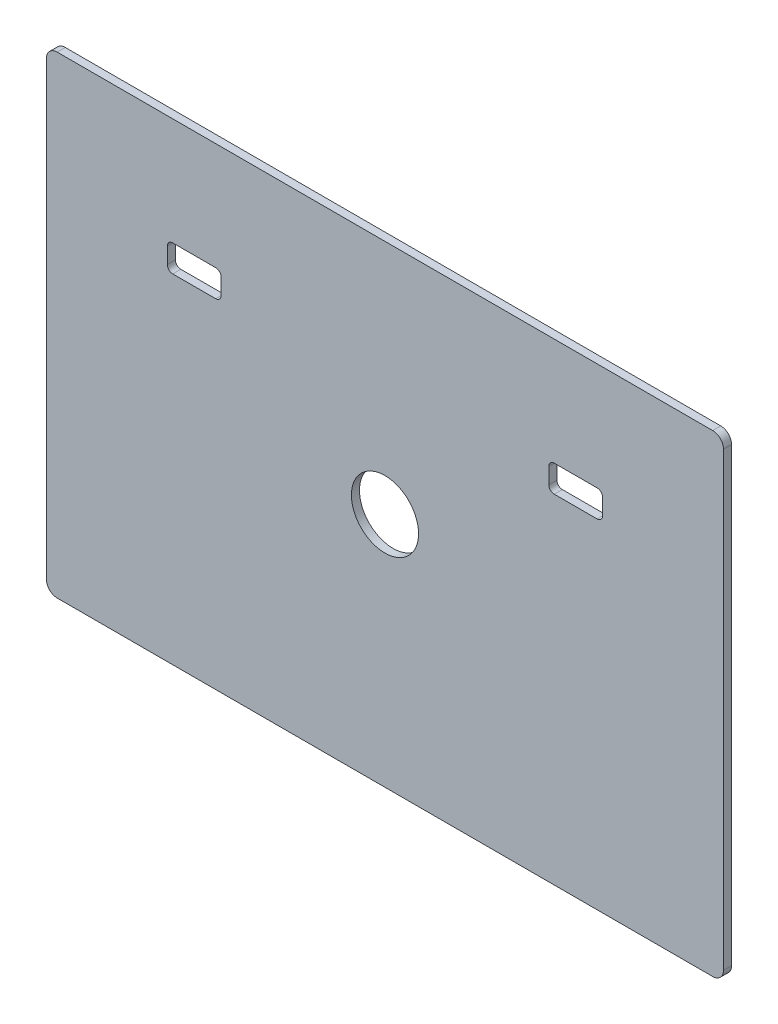
ISO-10303-21;
HEADER;
FILE_DESCRIPTION(('STEP AP214'),'2;1');
FILE_NAME('part.step','',(''),(''),'','','');
FILE_SCHEMA(('AUTOMOTIVE_DESIGN { 1 0 10303 214 1 1 1 1 }'));
ENDSEC;
DATA;
#1=APPLICATION_CONTEXT('core data for automotive mechanical design processes');
#2=APPLICATION_PROTOCOL_DEFINITION('international standard','automotive_design',2000,#1);
#3=PRODUCT_CONTEXT('',#1,'mechanical');
#4=PRODUCT('Part','Part','',(#3));
#5=PRODUCT_RELATED_PRODUCT_CATEGORY('part','',(#4));
#6=PRODUCT_DEFINITION_FORMATION('','',#4);
#7=PRODUCT_DEFINITION_CONTEXT('part definition',#1,'design');
#8=PRODUCT_DEFINITION('design','',#6,#7);
#9=PRODUCT_DEFINITION_SHAPE('','',#8);
#10=(LENGTH_UNIT() NAMED_UNIT(*) SI_UNIT(.MILLI.,.METRE.));
#11=(NAMED_UNIT(*) PLANE_ANGLE_UNIT() SI_UNIT($,.RADIAN.));
#12=(NAMED_UNIT(*) SI_UNIT($,.STERADIAN.) SOLID_ANGLE_UNIT());
#13=UNCERTAINTY_MEASURE_WITH_UNIT(LENGTH_MEASURE(1.E-05),#10,'distance_accuracy_value','');
#14=(GEOMETRIC_REPRESENTATION_CONTEXT(3) GLOBAL_UNCERTAINTY_ASSIGNED_CONTEXT((#13)) GLOBAL_UNIT_ASSIGNED_CONTEXT((#10,
#11,#12)) REPRESENTATION_CONTEXT('',''));
#15=CARTESIAN_POINT('',(0.,0.,0.));
#16=DIRECTION('',(0.,0.,1.));
#17=DIRECTION('',(1.,0.,0.));
#18=AXIS2_PLACEMENT_3D('',#15,#16,#17);
#19=CARTESIAN_POINT('',(126.,88.,3.));
#20=DIRECTION('',(-1.,0.,0.));
#21=DIRECTION('',(0.,-1.,0.));
#22=AXIS2_PLACEMENT_3D('',#19,#20,#21);
#23=PLANE('',#22);
#24=DIRECTION('',(0.,1.,0.));
#25=VECTOR('',#24,1.);
#26=CARTESIAN_POINT('',(126.,88.,3.));
#27=LINE('',#26,#25);
#28=CARTESIAN_POINT('',(126.,-84.,3.));
#29=VERTEX_POINT('',#28);
#30=CARTESIAN_POINT('',(126.,84.,3.));
#31=VERTEX_POINT('',#30);
#32=EDGE_CURVE('E245',#29,#31,#27,.T.);
#33=ORIENTED_EDGE('',*,*,#32,.F.);
#34=DIRECTION('',(0.,0.,-1.));
#35=VECTOR('',#34,1.);
#36=CARTESIAN_POINT('',(126.,-84.,3.));
#37=LINE('',#36,#35);
#38=CARTESIAN_POINT('',(126.,-84.,0.));
#39=VERTEX_POINT('',#38);
#40=EDGE_CURVE('E406',#29,#39,#37,.T.);
#41=ORIENTED_EDGE('',*,*,#40,.T.);
#42=DIRECTION('',(0.,1.,0.));
#43=VECTOR('',#42,1.);
#44=CARTESIAN_POINT('',(126.,88.,0.));
#45=LINE('',#44,#43);
#46=CARTESIAN_POINT('',(126.,84.,0.));
#47=VERTEX_POINT('',#46);
#48=EDGE_CURVE('E260',#39,#47,#45,.T.);
#49=ORIENTED_EDGE('',*,*,#48,.T.);
#50=DIRECTION('',(0.,0.,-1.));
#51=VECTOR('',#50,1.);
#52=CARTESIAN_POINT('',(126.,84.,3.));
#53=LINE('',#52,#51);
#54=EDGE_CURVE('E403',#47,#31,#53,.F.);
#55=ORIENTED_EDGE('',*,*,#54,.T.);
#56=EDGE_LOOP('',(#33,#41,#49,#55));
#57=FACE_BOUND('',#56,.T.);
#58=ADVANCED_FACE('F39',(#57),#23,.F.);
#59=CARTESIAN_POINT('',(-126.,88.,3.));
#60=DIRECTION('',(0.,-1.,0.));
#61=DIRECTION('',(0.,0.,-1.));
#62=AXIS2_PLACEMENT_3D('',#59,#60,#61);
#63=PLANE('',#62);
#64=DIRECTION('',(-1.,0.,0.));
#65=VECTOR('',#64,1.);
#66=CARTESIAN_POINT('',(-126.,88.,3.));
#67=LINE('',#66,#65);
#68=CARTESIAN_POINT('',(122.,88.,3.));
#69=VERTEX_POINT('',#68);
#70=CARTESIAN_POINT('',(-122.,88.,3.));
#71=VERTEX_POINT('',#70);
#72=EDGE_CURVE('E248',#69,#71,#67,.T.);
#73=ORIENTED_EDGE('',*,*,#72,.F.);
#74=DIRECTION('',(0.,0.,-1.));
#75=VECTOR('',#74,1.);
#76=CARTESIAN_POINT('',(122.,88.,3.));
#77=LINE('',#76,#75);
#78=CARTESIAN_POINT('',(122.,88.,0.));
#79=VERTEX_POINT('',#78);
#80=EDGE_CURVE('E11',#69,#79,#77,.T.);
#81=ORIENTED_EDGE('',*,*,#80,.T.);
#82=DIRECTION('',(-1.,0.,0.));
#83=VECTOR('',#82,1.);
#84=CARTESIAN_POINT('',(-126.,88.,0.));
#85=LINE('',#84,#83);
#86=CARTESIAN_POINT('',(-122.,88.,0.));
#87=VERTEX_POINT('',#86);
#88=EDGE_CURVE('E264',#79,#87,#85,.T.);
#89=ORIENTED_EDGE('',*,*,#88,.T.);
#90=DIRECTION('',(0.,0.,-1.));
#91=VECTOR('',#90,1.);
#92=CARTESIAN_POINT('',(-122.,88.,3.));
#93=LINE('',#92,#91);
#94=EDGE_CURVE('E48',#87,#71,#93,.F.);
#95=ORIENTED_EDGE('',*,*,#94,.T.);
#96=EDGE_LOOP('',(#73,#81,#89,#95));
#97=FACE_BOUND('',#96,.T.);
#98=ADVANCED_FACE('F493',(#97),#63,.F.);
#99=CARTESIAN_POINT('',(-126.,88.,3.));
#100=DIRECTION('',(1.,0.,0.));
#101=DIRECTION('',(0.,0.,-1.));
#102=AXIS2_PLACEMENT_3D('',#99,#100,#101);
#103=PLANE('',#102);
#104=DIRECTION('',(0.,-1.,0.));
#105=VECTOR('',#104,1.);
#106=CARTESIAN_POINT('',(-126.,88.,0.));
#107=LINE('',#106,#105);
#108=CARTESIAN_POINT('',(-126.,84.,0.));
#109=VERTEX_POINT('',#108);
#110=CARTESIAN_POINT('',(-126.,-84.,0.));
#111=VERTEX_POINT('',#110);
#112=EDGE_CURVE('E268',#109,#111,#107,.T.);
#113=ORIENTED_EDGE('',*,*,#112,.T.);
#114=DIRECTION('',(0.,0.,-1.));
#115=VECTOR('',#114,1.);
#116=CARTESIAN_POINT('',(-126.,-84.,3.));
#117=LINE('',#116,#115);
#118=CARTESIAN_POINT('',(-126.,-84.,3.));
#119=VERTEX_POINT('',#118);
#120=EDGE_CURVE('E389',#111,#119,#117,.F.);
#121=ORIENTED_EDGE('',*,*,#120,.T.);
#122=DIRECTION('',(0.,-1.,0.));
#123=VECTOR('',#122,1.);
#124=CARTESIAN_POINT('',(-126.,88.,3.));
#125=LINE('',#124,#123);
#126=CARTESIAN_POINT('',(-126.,84.,3.));
#127=VERTEX_POINT('',#126);
#128=EDGE_CURVE('E252',#127,#119,#125,.T.);
#129=ORIENTED_EDGE('',*,*,#128,.F.);
#130=DIRECTION('',(0.,0.,-1.));
#131=VECTOR('',#130,1.);
#132=CARTESIAN_POINT('',(-126.,84.,3.));
#133=LINE('',#132,#131);
#134=EDGE_CURVE('E385',#127,#109,#133,.T.);
#135=ORIENTED_EDGE('',*,*,#134,.T.);
#136=EDGE_LOOP('',(#113,#121,#129,#135));
#137=FACE_BOUND('',#136,.T.);
#138=ADVANCED_FACE('F499',(#137),#103,.F.);
#139=CARTESIAN_POINT('',(-126.,-88.,3.));
#140=DIRECTION('',(0.,1.,0.));
#141=DIRECTION('',(0.,0.,1.));
#142=AXIS2_PLACEMENT_3D('',#139,#140,#141);
#143=PLANE('',#142);
#144=DIRECTION('',(1.,0.,0.));
#145=VECTOR('',#144,1.);
#146=CARTESIAN_POINT('',(-126.,-88.,3.));
#147=LINE('',#146,#145);
#148=CARTESIAN_POINT('',(-122.,-88.,3.));
#149=VERTEX_POINT('',#148);
#150=CARTESIAN_POINT('',(122.,-88.,3.));
#151=VERTEX_POINT('',#150);
#152=EDGE_CURVE('E256',#149,#151,#147,.T.);
#153=ORIENTED_EDGE('',*,*,#152,.F.);
#154=DIRECTION('',(0.,0.,-1.));
#155=VECTOR('',#154,1.);
#156=CARTESIAN_POINT('',(-122.,-88.,3.));
#157=LINE('',#156,#155);
#158=CARTESIAN_POINT('',(-122.,-88.,0.));
#159=VERTEX_POINT('',#158);
#160=EDGE_CURVE('E369',#149,#159,#157,.T.);
#161=ORIENTED_EDGE('',*,*,#160,.T.);
#162=DIRECTION('',(1.,0.,0.));
#163=VECTOR('',#162,1.);
#164=CARTESIAN_POINT('',(-126.,-88.,0.));
#165=LINE('',#164,#163);
#166=CARTESIAN_POINT('',(122.,-88.,0.));
#167=VERTEX_POINT('',#166);
#168=EDGE_CURVE('E249',#159,#167,#165,.T.);
#169=ORIENTED_EDGE('',*,*,#168,.T.);
#170=DIRECTION('',(0.,0.,-1.));
#171=VECTOR('',#170,1.);
#172=CARTESIAN_POINT('',(122.,-88.,3.));
#173=LINE('',#172,#171);
#174=EDGE_CURVE('E366',#167,#151,#173,.F.);
#175=ORIENTED_EDGE('',*,*,#174,.T.);
#176=EDGE_LOOP('',(#153,#161,#169,#175));
#177=FACE_BOUND('',#176,.T.);
#178=ADVANCED_FACE('F562',(#177),#143,.F.);
#179=CARTESIAN_POINT('',(0.,0.,3.));
#180=DIRECTION('',(0.,0.,1.));
#181=DIRECTION('',(1.,0.,0.));
#182=AXIS2_PLACEMENT_3D('',#179,#180,#181);
#183=PLANE('',#182);
#184=CARTESIAN_POINT('',(0.,0.,3.));
#185=DIRECTION('',(0.,0.,1.));
#186=DIRECTION('',(1.,0.,0.));
#187=AXIS2_PLACEMENT_3D('',#184,#185,#186);
#188=CIRCLE('',#187,12.5);
#189=CARTESIAN_POINT('',(12.5,0.,3.));
#190=VERTEX_POINT('',#189);
#191=EDGE_CURVE('E413',#190,#190,#188,.T.);
#192=ORIENTED_EDGE('',*,*,#191,.F.);
#193=EDGE_LOOP('',(#192));
#194=FACE_BOUND('',#193,.T.);
#195=DIRECTION('',(0.,-1.,0.));
#196=VECTOR('',#195,1.);
#197=CARTESIAN_POINT('',(-81.,48.,3.));
#198=LINE('',#197,#196);
#199=CARTESIAN_POINT('',(-81.,46.,3.));
#200=VERTEX_POINT('',#199);
#201=CARTESIAN_POINT('',(-81.,40.,3.));
#202=VERTEX_POINT('',#201);
#203=EDGE_CURVE('E445',#200,#202,#198,.T.);
#204=ORIENTED_EDGE('',*,*,#203,.F.);
#205=CARTESIAN_POINT('',(-79.,46.,3.));
#206=DIRECTION('',(0.,0.,1.));
#207=DIRECTION('',(1.,0.,0.));
#208=AXIS2_PLACEMENT_3D('',#205,#206,#207);
#209=CIRCLE('',#208,2.);
#210=CARTESIAN_POINT('',(-79.,48.,3.));
#211=VERTEX_POINT('',#210);
#212=EDGE_CURVE('E354',#200,#211,#209,.F.);
#213=ORIENTED_EDGE('',*,*,#212,.T.);
#214=DIRECTION('',(-1.,0.,0.));
#215=VECTOR('',#214,1.);
#216=CARTESIAN_POINT('',(-81.,48.,3.));
#217=LINE('',#216,#215);
#218=CARTESIAN_POINT('',(-63.,48.,3.));
#219=VERTEX_POINT('',#218);
#220=EDGE_CURVE('E433',#219,#211,#217,.T.);
#221=ORIENTED_EDGE('',*,*,#220,.F.);
#222=CARTESIAN_POINT('',(-63.,46.,3.));
#223=DIRECTION('',(0.,0.,1.));
#224=DIRECTION('',(1.,0.,0.));
#225=AXIS2_PLACEMENT_3D('',#222,#223,#224);
#226=CIRCLE('',#225,2.);
#227=CARTESIAN_POINT('',(-61.,46.,3.));
#228=VERTEX_POINT('',#227);
#229=EDGE_CURVE('E360',#219,#228,#226,.F.);
#230=ORIENTED_EDGE('',*,*,#229,.T.);
#231=DIRECTION('',(0.,1.,0.));
#232=VECTOR('',#231,1.);
#233=CARTESIAN_POINT('',(-61.,48.,3.));
#234=LINE('',#233,#232);
#235=CARTESIAN_POINT('',(-61.,40.,3.));
#236=VERTEX_POINT('',#235);
#237=EDGE_CURVE('E437',#236,#228,#234,.T.);
#238=ORIENTED_EDGE('',*,*,#237,.F.);
#239=CARTESIAN_POINT('',(-63.,40.,3.));
#240=DIRECTION('',(0.,0.,1.));
#241=DIRECTION('',(1.,0.,0.));
#242=AXIS2_PLACEMENT_3D('',#239,#240,#241);
#243=CIRCLE('',#242,2.);
#244=CARTESIAN_POINT('',(-63.,38.,3.));
#245=VERTEX_POINT('',#244);
#246=EDGE_CURVE('E342',#236,#245,#243,.F.);
#247=ORIENTED_EDGE('',*,*,#246,.T.);
#248=DIRECTION('',(1.,0.,0.));
#249=VECTOR('',#248,1.);
#250=CARTESIAN_POINT('',(-81.,38.,3.));
#251=LINE('',#250,#249);
#252=CARTESIAN_POINT('',(-79.,38.,3.));
#253=VERTEX_POINT('',#252);
#254=EDGE_CURVE('E441',#253,#245,#251,.T.);
#255=ORIENTED_EDGE('',*,*,#254,.F.);
#256=CARTESIAN_POINT('',(-79.,40.,3.));
#257=DIRECTION('',(0.,0.,1.));
#258=DIRECTION('',(1.,0.,0.));
#259=AXIS2_PLACEMENT_3D('',#256,#257,#258);
#260=CIRCLE('',#259,2.);
#261=EDGE_CURVE('E348',#253,#202,#260,.F.);
#262=ORIENTED_EDGE('',*,*,#261,.T.);
#263=EDGE_LOOP('',(#204,#213,#221,#230,#238,#247,#255,#262));
#264=FACE_BOUND('',#263,.T.);
#265=DIRECTION('',(0.,1.,0.));
#266=VECTOR('',#265,1.);
#267=CARTESIAN_POINT('',(81.,38.,3.));
#268=LINE('',#267,#266);
#269=CARTESIAN_POINT('',(81.,40.,3.));
#270=VERTEX_POINT('',#269);
#271=CARTESIAN_POINT('',(81.,46.,3.));
#272=VERTEX_POINT('',#271);
#273=EDGE_CURVE('E241',#270,#272,#268,.T.);
#274=ORIENTED_EDGE('',*,*,#273,.F.);
#275=CARTESIAN_POINT('',(79.,40.,3.));
#276=DIRECTION('',(0.,0.,1.));
#277=DIRECTION('',(1.,0.,0.));
#278=AXIS2_PLACEMENT_3D('',#275,#276,#277);
#279=CIRCLE('',#278,2.);
#280=CARTESIAN_POINT('',(79.,38.,3.));
#281=VERTEX_POINT('',#280);
#282=EDGE_CURVE('E331',#270,#281,#279,.F.);
#283=ORIENTED_EDGE('',*,*,#282,.T.);
#284=DIRECTION('',(1.,0.,0.));
#285=VECTOR('',#284,1.);
#286=CARTESIAN_POINT('',(81.,38.,3.));
#287=LINE('',#286,#285);
#288=CARTESIAN_POINT('',(63.,38.,3.));
#289=VERTEX_POINT('',#288);
#290=EDGE_CURVE('E233',#289,#281,#287,.T.);
#291=ORIENTED_EDGE('',*,*,#290,.F.);
#292=CARTESIAN_POINT('',(63.,40.,3.));
#293=DIRECTION('',(0.,0.,1.));
#294=DIRECTION('',(1.,0.,0.));
#295=AXIS2_PLACEMENT_3D('',#292,#293,#294);
#296=CIRCLE('',#295,2.);
#297=CARTESIAN_POINT('',(61.,40.,3.));
#298=VERTEX_POINT('',#297);
#299=EDGE_CURVE('E231',#289,#298,#296,.F.);
#300=ORIENTED_EDGE('',*,*,#299,.T.);
#301=DIRECTION('',(0.,-1.,0.));
#302=VECTOR('',#301,1.);
#303=CARTESIAN_POINT('',(61.,38.,3.));
#304=LINE('',#303,#302);
#305=CARTESIAN_POINT('',(61.,46.,3.));
#306=VERTEX_POINT('',#305);
#307=EDGE_CURVE('E220',#306,#298,#304,.T.);
#308=ORIENTED_EDGE('',*,*,#307,.F.);
#309=CARTESIAN_POINT('',(63.,46.,3.));
#310=DIRECTION('',(0.,0.,1.));
#311=DIRECTION('',(1.,0.,0.));
#312=AXIS2_PLACEMENT_3D('',#309,#310,#311);
#313=CIRCLE('',#312,2.);
#314=CARTESIAN_POINT('',(63.,48.,3.));
#315=VERTEX_POINT('',#314);
#316=EDGE_CURVE('E202',#306,#315,#313,.F.);
#317=ORIENTED_EDGE('',*,*,#316,.T.);
#318=DIRECTION('',(-1.,0.,0.));
#319=VECTOR('',#318,1.);
#320=CARTESIAN_POINT('',(81.,48.,3.));
#321=LINE('',#320,#319);
#322=CARTESIAN_POINT('',(79.,48.,3.));
#323=VERTEX_POINT('',#322);
#324=EDGE_CURVE('E234',#323,#315,#321,.T.);
#325=ORIENTED_EDGE('',*,*,#324,.F.);
#326=CARTESIAN_POINT('',(79.,46.,3.));
#327=DIRECTION('',(0.,0.,1.));
#328=DIRECTION('',(1.,0.,0.));
#329=AXIS2_PLACEMENT_3D('',#326,#327,#328);
#330=CIRCLE('',#329,2.);
#331=EDGE_CURVE('E325',#323,#272,#330,.F.);
#332=ORIENTED_EDGE('',*,*,#331,.T.);
#333=EDGE_LOOP('',(#274,#283,#291,#300,#308,#317,#325,#332));
#334=FACE_BOUND('',#333,.T.);
#335=ORIENTED_EDGE('',*,*,#128,.T.);
#336=CARTESIAN_POINT('',(-122.,-84.,3.));
#337=DIRECTION('',(0.,0.,1.));
#338=DIRECTION('',(1.,0.,0.));
#339=AXIS2_PLACEMENT_3D('',#336,#337,#338);
#340=CIRCLE('',#339,4.);
#341=EDGE_CURVE('E400',#119,#149,#340,.T.);
#342=ORIENTED_EDGE('',*,*,#341,.T.);
#343=ORIENTED_EDGE('',*,*,#152,.T.);
#344=CARTESIAN_POINT('',(122.,-84.,3.));
#345=DIRECTION('',(0.,0.,1.));
#346=DIRECTION('',(1.,0.,0.));
#347=AXIS2_PLACEMENT_3D('',#344,#345,#346);
#348=CIRCLE('',#347,4.);
#349=EDGE_CURVE('E397',#151,#29,#348,.T.);
#350=ORIENTED_EDGE('',*,*,#349,.T.);
#351=ORIENTED_EDGE('',*,*,#32,.T.);
#352=CARTESIAN_POINT('',(122.,84.,3.));
#353=DIRECTION('',(0.,0.,1.));
#354=DIRECTION('',(1.,0.,0.));
#355=AXIS2_PLACEMENT_3D('',#352,#353,#354);
#356=CIRCLE('',#355,4.);
#357=EDGE_CURVE('E61',#31,#69,#356,.T.);
#358=ORIENTED_EDGE('',*,*,#357,.T.);
#359=ORIENTED_EDGE('',*,*,#72,.T.);
#360=CARTESIAN_POINT('',(-122.,84.,3.));
#361=DIRECTION('',(0.,0.,1.));
#362=DIRECTION('',(1.,0.,0.));
#363=AXIS2_PLACEMENT_3D('',#360,#361,#362);
#364=CIRCLE('',#363,4.);
#365=EDGE_CURVE('E392',#71,#127,#364,.T.);
#366=ORIENTED_EDGE('',*,*,#365,.T.);
#367=EDGE_LOOP('',(#335,#342,#343,#350,#351,#358,#359,#366));
#368=FACE_BOUND('',#367,.T.);
#369=ADVANCED_FACE('F229',(#194,#264,#334,#368),#183,.T.);
#370=CARTESIAN_POINT('',(0.,0.,0.));
#371=DIRECTION('',(0.,0.,1.));
#372=DIRECTION('',(1.,0.,0.));
#373=AXIS2_PLACEMENT_3D('',#370,#371,#372);
#374=PLANE('',#373);
#375=CARTESIAN_POINT('',(0.,0.,0.));
#376=DIRECTION('',(0.,0.,1.));
#377=DIRECTION('',(1.,0.,0.));
#378=AXIS2_PLACEMENT_3D('',#375,#376,#377);
#379=CIRCLE('',#378,12.5);
#380=CARTESIAN_POINT('',(12.5,0.,0.));
#381=VERTEX_POINT('',#380);
#382=EDGE_CURVE('E265',#381,#381,#379,.T.);
#383=ORIENTED_EDGE('',*,*,#382,.T.);
#384=EDGE_LOOP('',(#383));
#385=FACE_BOUND('',#384,.T.);
#386=DIRECTION('',(0.,1.,0.));
#387=VECTOR('',#386,1.);
#388=CARTESIAN_POINT('',(-61.,48.,0.));
#389=LINE('',#388,#387);
#390=CARTESIAN_POINT('',(-61.,40.,0.));
#391=VERTEX_POINT('',#390);
#392=CARTESIAN_POINT('',(-61.,46.,0.));
#393=VERTEX_POINT('',#392);
#394=EDGE_CURVE('E421',#391,#393,#389,.T.);
#395=ORIENTED_EDGE('',*,*,#394,.T.);
#396=CARTESIAN_POINT('',(-63.,46.,0.));
#397=DIRECTION('',(0.,0.,1.));
#398=DIRECTION('',(1.,0.,0.));
#399=AXIS2_PLACEMENT_3D('',#396,#397,#398);
#400=CIRCLE('',#399,2.);
#401=CARTESIAN_POINT('',(-63.,48.,0.));
#402=VERTEX_POINT('',#401);
#403=EDGE_CURVE('E363',#393,#402,#400,.T.);
#404=ORIENTED_EDGE('',*,*,#403,.T.);
#405=DIRECTION('',(-1.,0.,0.));
#406=VECTOR('',#405,1.);
#407=CARTESIAN_POINT('',(-81.,48.,0.));
#408=LINE('',#407,#406);
#409=CARTESIAN_POINT('',(-79.,48.,0.));
#410=VERTEX_POINT('',#409);
#411=EDGE_CURVE('E417',#402,#410,#408,.T.);
#412=ORIENTED_EDGE('',*,*,#411,.T.);
#413=CARTESIAN_POINT('',(-79.,46.,0.));
#414=DIRECTION('',(0.,0.,1.));
#415=DIRECTION('',(1.,0.,0.));
#416=AXIS2_PLACEMENT_3D('',#413,#414,#415);
#417=CIRCLE('',#416,2.);
#418=CARTESIAN_POINT('',(-81.,46.,0.));
#419=VERTEX_POINT('',#418);
#420=EDGE_CURVE('E357',#410,#419,#417,.T.);
#421=ORIENTED_EDGE('',*,*,#420,.T.);
#422=DIRECTION('',(0.,-1.,0.));
#423=VECTOR('',#422,1.);
#424=CARTESIAN_POINT('',(-81.,48.,0.));
#425=LINE('',#424,#423);
#426=CARTESIAN_POINT('',(-81.,40.,0.));
#427=VERTEX_POINT('',#426);
#428=EDGE_CURVE('E429',#419,#427,#425,.T.);
#429=ORIENTED_EDGE('',*,*,#428,.T.);
#430=CARTESIAN_POINT('',(-79.,40.,0.));
#431=DIRECTION('',(0.,0.,1.));
#432=DIRECTION('',(1.,0.,0.));
#433=AXIS2_PLACEMENT_3D('',#430,#431,#432);
#434=CIRCLE('',#433,2.);
#435=CARTESIAN_POINT('',(-79.,38.,0.));
#436=VERTEX_POINT('',#435);
#437=EDGE_CURVE('E351',#427,#436,#434,.T.);
#438=ORIENTED_EDGE('',*,*,#437,.T.);
#439=DIRECTION('',(1.,0.,0.));
#440=VECTOR('',#439,1.);
#441=CARTESIAN_POINT('',(-81.,38.,0.));
#442=LINE('',#441,#440);
#443=CARTESIAN_POINT('',(-63.,38.,0.));
#444=VERTEX_POINT('',#443);
#445=EDGE_CURVE('E425',#436,#444,#442,.T.);
#446=ORIENTED_EDGE('',*,*,#445,.T.);
#447=CARTESIAN_POINT('',(-63.,40.,0.));
#448=DIRECTION('',(0.,0.,1.));
#449=DIRECTION('',(1.,0.,0.));
#450=AXIS2_PLACEMENT_3D('',#447,#448,#449);
#451=CIRCLE('',#450,2.);
#452=EDGE_CURVE('E345',#444,#391,#451,.T.);
#453=ORIENTED_EDGE('',*,*,#452,.T.);
#454=EDGE_LOOP('',(#395,#404,#412,#421,#429,#438,#446,#453));
#455=FACE_BOUND('',#454,.T.);
#456=DIRECTION('',(0.,-1.,0.));
#457=VECTOR('',#456,1.);
#458=CARTESIAN_POINT('',(61.,38.,0.));
#459=LINE('',#458,#457);
#460=CARTESIAN_POINT('',(61.,46.,0.));
#461=VERTEX_POINT('',#460);
#462=CARTESIAN_POINT('',(61.,40.,0.));
#463=VERTEX_POINT('',#462);
#464=EDGE_CURVE('E223',#461,#463,#459,.T.);
#465=ORIENTED_EDGE('',*,*,#464,.T.);
#466=CARTESIAN_POINT('',(63.,40.,0.));
#467=DIRECTION('',(0.,0.,1.));
#468=DIRECTION('',(1.,0.,0.));
#469=AXIS2_PLACEMENT_3D('',#466,#467,#468);
#470=CIRCLE('',#469,2.);
#471=CARTESIAN_POINT('',(63.,38.,0.));
#472=VERTEX_POINT('',#471);
#473=EDGE_CURVE('E339',#463,#472,#470,.T.);
#474=ORIENTED_EDGE('',*,*,#473,.T.);
#475=DIRECTION('',(1.,0.,0.));
#476=VECTOR('',#475,1.);
#477=CARTESIAN_POINT('',(81.,38.,0.));
#478=LINE('',#477,#476);
#479=CARTESIAN_POINT('',(79.,38.,0.));
#480=VERTEX_POINT('',#479);
#481=EDGE_CURVE('E449',#472,#480,#478,.T.);
#482=ORIENTED_EDGE('',*,*,#481,.T.);
#483=CARTESIAN_POINT('',(79.,40.,0.));
#484=DIRECTION('',(0.,0.,1.));
#485=DIRECTION('',(1.,0.,0.));
#486=AXIS2_PLACEMENT_3D('',#483,#484,#485);
#487=CIRCLE('',#486,2.);
#488=CARTESIAN_POINT('',(81.,40.,0.));
#489=VERTEX_POINT('',#488);
#490=EDGE_CURVE('E334',#480,#489,#487,.T.);
#491=ORIENTED_EDGE('',*,*,#490,.T.);
#492=DIRECTION('',(0.,1.,0.));
#493=VECTOR('',#492,1.);
#494=CARTESIAN_POINT('',(81.,38.,0.));
#495=LINE('',#494,#493);
#496=CARTESIAN_POINT('',(81.,46.,0.));
#497=VERTEX_POINT('',#496);
#498=EDGE_CURVE('E239',#489,#497,#495,.T.);
#499=ORIENTED_EDGE('',*,*,#498,.T.);
#500=CARTESIAN_POINT('',(79.,46.,0.));
#501=DIRECTION('',(0.,0.,1.));
#502=DIRECTION('',(1.,0.,0.));
#503=AXIS2_PLACEMENT_3D('',#500,#501,#502);
#504=CIRCLE('',#503,2.);
#505=CARTESIAN_POINT('',(79.,48.,0.));
#506=VERTEX_POINT('',#505);
#507=EDGE_CURVE('E328',#497,#506,#504,.T.);
#508=ORIENTED_EDGE('',*,*,#507,.T.);
#509=DIRECTION('',(-1.,0.,0.));
#510=VECTOR('',#509,1.);
#511=CARTESIAN_POINT('',(81.,48.,0.));
#512=LINE('',#511,#510);
#513=CARTESIAN_POINT('',(63.,48.,0.));
#514=VERTEX_POINT('',#513);
#515=EDGE_CURVE('E455',#506,#514,#512,.T.);
#516=ORIENTED_EDGE('',*,*,#515,.T.);
#517=CARTESIAN_POINT('',(63.,46.,0.));
#518=DIRECTION('',(0.,0.,1.));
#519=DIRECTION('',(1.,0.,0.));
#520=AXIS2_PLACEMENT_3D('',#517,#518,#519);
#521=CIRCLE('',#520,2.);
#522=EDGE_CURVE('E213',#514,#461,#521,.T.);
#523=ORIENTED_EDGE('',*,*,#522,.T.);
#524=EDGE_LOOP('',(#465,#474,#482,#491,#499,#508,#516,#523));
#525=FACE_BOUND('',#524,.T.);
#526=ORIENTED_EDGE('',*,*,#168,.F.);
#527=CARTESIAN_POINT('',(-122.,-84.,0.));
#528=DIRECTION('',(0.,0.,1.));
#529=DIRECTION('',(1.,0.,0.));
#530=AXIS2_PLACEMENT_3D('',#527,#528,#529);
#531=CIRCLE('',#530,4.);
#532=EDGE_CURVE('E382',#159,#111,#531,.F.);
#533=ORIENTED_EDGE('',*,*,#532,.T.);
#534=ORIENTED_EDGE('',*,*,#112,.F.);
#535=CARTESIAN_POINT('',(-122.,84.,0.));
#536=DIRECTION('',(0.,0.,1.));
#537=DIRECTION('',(1.,0.,0.));
#538=AXIS2_PLACEMENT_3D('',#535,#536,#537);
#539=CIRCLE('',#538,4.);
#540=EDGE_CURVE('E373',#109,#87,#539,.F.);
#541=ORIENTED_EDGE('',*,*,#540,.T.);
#542=ORIENTED_EDGE('',*,*,#88,.F.);
#543=CARTESIAN_POINT('',(122.,84.,0.));
#544=DIRECTION('',(0.,0.,1.));
#545=DIRECTION('',(1.,0.,0.));
#546=AXIS2_PLACEMENT_3D('',#543,#544,#545);
#547=CIRCLE('',#546,4.);
#548=EDGE_CURVE('E376',#79,#47,#547,.F.);
#549=ORIENTED_EDGE('',*,*,#548,.T.);
#550=ORIENTED_EDGE('',*,*,#48,.F.);
#551=CARTESIAN_POINT('',(122.,-84.,0.));
#552=DIRECTION('',(0.,0.,1.));
#553=DIRECTION('',(1.,0.,0.));
#554=AXIS2_PLACEMENT_3D('',#551,#552,#553);
#555=CIRCLE('',#554,4.);
#556=EDGE_CURVE('E379',#39,#167,#555,.F.);
#557=ORIENTED_EDGE('',*,*,#556,.T.);
#558=EDGE_LOOP('',(#526,#533,#534,#541,#542,#549,#550,#557));
#559=FACE_BOUND('',#558,.T.);
#560=ADVANCED_FACE('F475',(#385,#455,#525,#559),#374,.F.);
#561=CARTESIAN_POINT('',(81.,38.,0.));
#562=DIRECTION('',(1.,0.,0.));
#563=DIRECTION('',(0.,0.,-1.));
#564=AXIS2_PLACEMENT_3D('',#561,#562,#563);
#565=PLANE('',#564);
#566=ORIENTED_EDGE('',*,*,#273,.T.);
#567=DIRECTION('',(0.,0.,1.));
#568=VECTOR('',#567,1.);
#569=CARTESIAN_POINT('',(81.,46.,0.));
#570=LINE('',#569,#568);
#571=EDGE_CURVE('E286',#272,#497,#570,.F.);
#572=ORIENTED_EDGE('',*,*,#571,.T.);
#573=ORIENTED_EDGE('',*,*,#498,.F.);
#574=DIRECTION('',(0.,0.,1.));
#575=VECTOR('',#574,1.);
#576=CARTESIAN_POINT('',(81.,40.,3.));
#577=LINE('',#576,#575);
#578=EDGE_CURVE('E282',#489,#270,#577,.T.);
#579=ORIENTED_EDGE('',*,*,#578,.T.);
#580=EDGE_LOOP('',(#566,#572,#573,#579));
#581=FACE_BOUND('',#580,.T.);
#582=ADVANCED_FACE('F469',(#581),#565,.F.);
#583=CARTESIAN_POINT('',(81.,38.,0.));
#584=DIRECTION('',(0.,-1.,0.));
#585=DIRECTION('',(1.,0.,0.));
#586=AXIS2_PLACEMENT_3D('',#583,#584,#585);
#587=PLANE('',#586);
#588=ORIENTED_EDGE('',*,*,#290,.T.);
#589=DIRECTION('',(0.,0.,1.));
#590=VECTOR('',#589,1.);
#591=CARTESIAN_POINT('',(79.,38.,0.));
#592=LINE('',#591,#590);
#593=EDGE_CURVE('E293',#281,#480,#592,.F.);
#594=ORIENTED_EDGE('',*,*,#593,.T.);
#595=ORIENTED_EDGE('',*,*,#481,.F.);
#596=DIRECTION('',(0.,0.,1.));
#597=VECTOR('',#596,1.);
#598=CARTESIAN_POINT('',(63.,38.,3.));
#599=LINE('',#598,#597);
#600=EDGE_CURVE('E289',#472,#289,#599,.T.);
#601=ORIENTED_EDGE('',*,*,#600,.T.);
#602=EDGE_LOOP('',(#588,#594,#595,#601));
#603=FACE_BOUND('',#602,.T.);
#604=ADVANCED_FACE('F489',(#603),#587,.F.);
#605=CARTESIAN_POINT('',(61.,38.,0.));
#606=DIRECTION('',(-1.,0.,0.));
#607=DIRECTION('',(0.,0.,1.));
#608=AXIS2_PLACEMENT_3D('',#605,#606,#607);
#609=PLANE('',#608);
#610=ORIENTED_EDGE('',*,*,#464,.F.);
#611=DIRECTION('',(0.,0.,1.));
#612=VECTOR('',#611,1.);
#613=CARTESIAN_POINT('',(61.,46.,3.));
#614=LINE('',#613,#612);
#615=EDGE_CURVE('E206',#461,#306,#614,.T.);
#616=ORIENTED_EDGE('',*,*,#615,.T.);
#617=ORIENTED_EDGE('',*,*,#307,.T.);
#618=DIRECTION('',(0.,0.,1.));
#619=VECTOR('',#618,1.);
#620=CARTESIAN_POINT('',(61.,40.,0.));
#621=LINE('',#620,#619);
#622=EDGE_CURVE('E226',#298,#463,#621,.F.);
#623=ORIENTED_EDGE('',*,*,#622,.T.);
#624=EDGE_LOOP('',(#610,#616,#617,#623));
#625=FACE_BOUND('',#624,.T.);
#626=ADVANCED_FACE('F219',(#625),#609,.F.);
#627=CARTESIAN_POINT('',(81.,48.,0.));
#628=DIRECTION('',(0.,1.,0.));
#629=DIRECTION('',(0.,0.,1.));
#630=AXIS2_PLACEMENT_3D('',#627,#628,#629);
#631=PLANE('',#630);
#632=ORIENTED_EDGE('',*,*,#324,.T.);
#633=DIRECTION('',(0.,0.,1.));
#634=VECTOR('',#633,1.);
#635=CARTESIAN_POINT('',(63.,48.,0.));
#636=LINE('',#635,#634);
#637=EDGE_CURVE('E207',#315,#514,#636,.F.);
#638=ORIENTED_EDGE('',*,*,#637,.T.);
#639=ORIENTED_EDGE('',*,*,#515,.F.);
#640=DIRECTION('',(0.,0.,1.));
#641=VECTOR('',#640,1.);
#642=CARTESIAN_POINT('',(79.,48.,3.));
#643=LINE('',#642,#641);
#644=EDGE_CURVE('E225',#506,#323,#643,.T.);
#645=ORIENTED_EDGE('',*,*,#644,.T.);
#646=EDGE_LOOP('',(#632,#638,#639,#645));
#647=FACE_BOUND('',#646,.T.);
#648=ADVANCED_FACE('F478',(#647),#631,.F.);
#649=CARTESIAN_POINT('',(-81.,48.,0.));
#650=DIRECTION('',(-1.,0.,0.));
#651=DIRECTION('',(0.,-1.,0.));
#652=AXIS2_PLACEMENT_3D('',#649,#650,#651);
#653=PLANE('',#652);
#654=ORIENTED_EDGE('',*,*,#203,.T.);
#655=DIRECTION('',(0.,0.,1.));
#656=VECTOR('',#655,1.);
#657=CARTESIAN_POINT('',(-81.,40.,0.));
#658=LINE('',#657,#656);
#659=EDGE_CURVE('E314',#202,#427,#658,.F.);
#660=ORIENTED_EDGE('',*,*,#659,.T.);
#661=ORIENTED_EDGE('',*,*,#428,.F.);
#662=DIRECTION('',(0.,0.,1.));
#663=VECTOR('',#662,1.);
#664=CARTESIAN_POINT('',(-81.,46.,3.));
#665=LINE('',#664,#663);
#666=EDGE_CURVE('E310',#419,#200,#665,.T.);
#667=ORIENTED_EDGE('',*,*,#666,.T.);
#668=EDGE_LOOP('',(#654,#660,#661,#667));
#669=FACE_BOUND('',#668,.T.);
#670=ADVANCED_FACE('F480',(#669),#653,.F.);
#671=CARTESIAN_POINT('',(-81.,48.,0.));
#672=DIRECTION('',(0.,1.,0.));
#673=DIRECTION('',(0.,0.,1.));
#674=AXIS2_PLACEMENT_3D('',#671,#672,#673);
#675=PLANE('',#674);
#676=ORIENTED_EDGE('',*,*,#220,.T.);
#677=DIRECTION('',(0.,0.,1.));
#678=VECTOR('',#677,1.);
#679=CARTESIAN_POINT('',(-79.,48.,0.));
#680=LINE('',#679,#678);
#681=EDGE_CURVE('E214',#211,#410,#680,.F.);
#682=ORIENTED_EDGE('',*,*,#681,.T.);
#683=ORIENTED_EDGE('',*,*,#411,.F.);
#684=DIRECTION('',(0.,0.,1.));
#685=VECTOR('',#684,1.);
#686=CARTESIAN_POINT('',(-63.,48.,3.));
#687=LINE('',#686,#685);
#688=EDGE_CURVE('E317',#402,#219,#687,.T.);
#689=ORIENTED_EDGE('',*,*,#688,.T.);
#690=EDGE_LOOP('',(#676,#682,#683,#689));
#691=FACE_BOUND('',#690,.T.);
#692=ADVANCED_FACE('F486',(#691),#675,.F.);
#693=CARTESIAN_POINT('',(-61.,48.,0.));
#694=DIRECTION('',(1.,0.,0.));
#695=DIRECTION('',(0.,0.,-1.));
#696=AXIS2_PLACEMENT_3D('',#693,#694,#695);
#697=PLANE('',#696);
#698=ORIENTED_EDGE('',*,*,#394,.F.);
#699=DIRECTION('',(0.,0.,1.));
#700=VECTOR('',#699,1.);
#701=CARTESIAN_POINT('',(-61.,40.,3.));
#702=LINE('',#701,#700);
#703=EDGE_CURVE('E299',#391,#236,#702,.T.);
#704=ORIENTED_EDGE('',*,*,#703,.T.);
#705=ORIENTED_EDGE('',*,*,#237,.T.);
#706=DIRECTION('',(0.,0.,1.));
#707=VECTOR('',#706,1.);
#708=CARTESIAN_POINT('',(-61.,46.,0.));
#709=LINE('',#708,#707);
#710=EDGE_CURVE('E296',#228,#393,#709,.F.);
#711=ORIENTED_EDGE('',*,*,#710,.T.);
#712=EDGE_LOOP('',(#698,#704,#705,#711));
#713=FACE_BOUND('',#712,.T.);
#714=ADVANCED_FACE('F589',(#713),#697,.F.);
#715=CARTESIAN_POINT('',(-81.,38.,0.));
#716=DIRECTION('',(0.,-1.,0.));
#717=DIRECTION('',(1.,0.,0.));
#718=AXIS2_PLACEMENT_3D('',#715,#716,#717);
#719=PLANE('',#718);
#720=ORIENTED_EDGE('',*,*,#254,.T.);
#721=DIRECTION('',(0.,0.,1.));
#722=VECTOR('',#721,1.);
#723=CARTESIAN_POINT('',(-63.,38.,0.));
#724=LINE('',#723,#722);
#725=EDGE_CURVE('E307',#245,#444,#724,.F.);
#726=ORIENTED_EDGE('',*,*,#725,.T.);
#727=ORIENTED_EDGE('',*,*,#445,.F.);
#728=DIRECTION('',(0.,0.,1.));
#729=VECTOR('',#728,1.);
#730=CARTESIAN_POINT('',(-79.,38.,3.));
#731=LINE('',#730,#729);
#732=EDGE_CURVE('E303',#436,#253,#731,.T.);
#733=ORIENTED_EDGE('',*,*,#732,.T.);
#734=EDGE_LOOP('',(#720,#726,#727,#733));
#735=FACE_BOUND('',#734,.T.);
#736=ADVANCED_FACE('F586',(#735),#719,.F.);
#737=CARTESIAN_POINT('',(0.,0.,0.));
#738=DIRECTION('',(0.,0.,1.));
#739=DIRECTION('',(1.,0.,0.));
#740=AXIS2_PLACEMENT_3D('',#737,#738,#739);
#741=CYLINDRICAL_SURFACE('',#740,12.5);
#742=ORIENTED_EDGE('',*,*,#382,.F.);
#743=EDGE_LOOP('',(#742));
#744=FACE_BOUND('',#743,.T.);
#745=ORIENTED_EDGE('',*,*,#191,.T.);
#746=EDGE_LOOP('',(#745));
#747=FACE_BOUND('',#746,.T.);
#748=ADVANCED_FACE('F506',(#744,#747),#741,.F.);
#749=CARTESIAN_POINT('',(63.,46.,0.));
#750=DIRECTION('',(0.,0.,-1.));
#751=DIRECTION('',(-1.,0.,0.));
#752=AXIS2_PLACEMENT_3D('',#749,#750,#751);
#753=CYLINDRICAL_SURFACE('',#752,2.);
#754=ORIENTED_EDGE('',*,*,#522,.F.);
#755=ORIENTED_EDGE('',*,*,#637,.F.);
#756=ORIENTED_EDGE('',*,*,#316,.F.);
#757=ORIENTED_EDGE('',*,*,#615,.F.);
#758=EDGE_LOOP('',(#754,#755,#756,#757));
#759=FACE_BOUND('',#758,.T.);
#760=ADVANCED_FACE('F205',(#759),#753,.F.);
#761=CARTESIAN_POINT('',(79.,46.,0.));
#762=DIRECTION('',(0.,0.,-1.));
#763=DIRECTION('',(-1.,0.,0.));
#764=AXIS2_PLACEMENT_3D('',#761,#762,#763);
#765=CYLINDRICAL_SURFACE('',#764,2.);
#766=ORIENTED_EDGE('',*,*,#507,.F.);
#767=ORIENTED_EDGE('',*,*,#571,.F.);
#768=ORIENTED_EDGE('',*,*,#331,.F.);
#769=ORIENTED_EDGE('',*,*,#644,.F.);
#770=EDGE_LOOP('',(#766,#767,#768,#769));
#771=FACE_BOUND('',#770,.T.);
#772=ADVANCED_FACE('F472',(#771),#765,.F.);
#773=CARTESIAN_POINT('',(79.,40.,0.));
#774=DIRECTION('',(0.,0.,-1.));
#775=DIRECTION('',(-1.,0.,0.));
#776=AXIS2_PLACEMENT_3D('',#773,#774,#775);
#777=CYLINDRICAL_SURFACE('',#776,2.);
#778=ORIENTED_EDGE('',*,*,#490,.F.);
#779=ORIENTED_EDGE('',*,*,#593,.F.);
#780=ORIENTED_EDGE('',*,*,#282,.F.);
#781=ORIENTED_EDGE('',*,*,#578,.F.);
#782=EDGE_LOOP('',(#778,#779,#780,#781));
#783=FACE_BOUND('',#782,.T.);
#784=ADVANCED_FACE('F509',(#783),#777,.F.);
#785=CARTESIAN_POINT('',(63.,40.,0.));
#786=DIRECTION('',(0.,0.,-1.));
#787=DIRECTION('',(-1.,0.,0.));
#788=AXIS2_PLACEMENT_3D('',#785,#786,#787);
#789=CYLINDRICAL_SURFACE('',#788,2.);
#790=ORIENTED_EDGE('',*,*,#473,.F.);
#791=ORIENTED_EDGE('',*,*,#622,.F.);
#792=ORIENTED_EDGE('',*,*,#299,.F.);
#793=ORIENTED_EDGE('',*,*,#600,.F.);
#794=EDGE_LOOP('',(#790,#791,#792,#793));
#795=FACE_BOUND('',#794,.T.);
#796=ADVANCED_FACE('F512',(#795),#789,.F.);
#797=CARTESIAN_POINT('',(-63.,40.,0.));
#798=DIRECTION('',(0.,0.,-1.));
#799=DIRECTION('',(-1.,0.,0.));
#800=AXIS2_PLACEMENT_3D('',#797,#798,#799);
#801=CYLINDRICAL_SURFACE('',#800,2.);
#802=ORIENTED_EDGE('',*,*,#452,.F.);
#803=ORIENTED_EDGE('',*,*,#725,.F.);
#804=ORIENTED_EDGE('',*,*,#246,.F.);
#805=ORIENTED_EDGE('',*,*,#703,.F.);
#806=EDGE_LOOP('',(#802,#803,#804,#805));
#807=FACE_BOUND('',#806,.T.);
#808=ADVANCED_FACE('F516',(#807),#801,.F.);
#809=CARTESIAN_POINT('',(-79.,40.,0.));
#810=DIRECTION('',(0.,0.,-1.));
#811=DIRECTION('',(-1.,0.,0.));
#812=AXIS2_PLACEMENT_3D('',#809,#810,#811);
#813=CYLINDRICAL_SURFACE('',#812,2.);
#814=ORIENTED_EDGE('',*,*,#437,.F.);
#815=ORIENTED_EDGE('',*,*,#659,.F.);
#816=ORIENTED_EDGE('',*,*,#261,.F.);
#817=ORIENTED_EDGE('',*,*,#732,.F.);
#818=EDGE_LOOP('',(#814,#815,#816,#817));
#819=FACE_BOUND('',#818,.T.);
#820=ADVANCED_FACE('F520',(#819),#813,.F.);
#821=CARTESIAN_POINT('',(-79.,46.,0.));
#822=DIRECTION('',(0.,0.,-1.));
#823=DIRECTION('',(-1.,0.,0.));
#824=AXIS2_PLACEMENT_3D('',#821,#822,#823);
#825=CYLINDRICAL_SURFACE('',#824,2.);
#826=ORIENTED_EDGE('',*,*,#420,.F.);
#827=ORIENTED_EDGE('',*,*,#681,.F.);
#828=ORIENTED_EDGE('',*,*,#212,.F.);
#829=ORIENTED_EDGE('',*,*,#666,.F.);
#830=EDGE_LOOP('',(#826,#827,#828,#829));
#831=FACE_BOUND('',#830,.T.);
#832=ADVANCED_FACE('F524',(#831),#825,.F.);
#833=CARTESIAN_POINT('',(-63.,46.,0.));
#834=DIRECTION('',(0.,0.,-1.));
#835=DIRECTION('',(-1.,0.,0.));
#836=AXIS2_PLACEMENT_3D('',#833,#834,#835);
#837=CYLINDRICAL_SURFACE('',#836,2.);
#838=ORIENTED_EDGE('',*,*,#403,.F.);
#839=ORIENTED_EDGE('',*,*,#710,.F.);
#840=ORIENTED_EDGE('',*,*,#229,.F.);
#841=ORIENTED_EDGE('',*,*,#688,.F.);
#842=EDGE_LOOP('',(#838,#839,#840,#841));
#843=FACE_BOUND('',#842,.T.);
#844=ADVANCED_FACE('F528',(#843),#837,.F.);
#845=CARTESIAN_POINT('',(-122.,-84.,3.));
#846=DIRECTION('',(0.,0.,-1.));
#847=DIRECTION('',(-1.,0.,0.));
#848=AXIS2_PLACEMENT_3D('',#845,#846,#847);
#849=CYLINDRICAL_SURFACE('',#848,4.);
#850=ORIENTED_EDGE('',*,*,#341,.F.);
#851=ORIENTED_EDGE('',*,*,#120,.F.);
#852=ORIENTED_EDGE('',*,*,#532,.F.);
#853=ORIENTED_EDGE('',*,*,#160,.F.);
#854=EDGE_LOOP('',(#850,#851,#852,#853));
#855=FACE_BOUND('',#854,.T.);
#856=ADVANCED_FACE('F532',(#855),#849,.T.);
#857=CARTESIAN_POINT('',(122.,-84.,3.));
#858=DIRECTION('',(0.,0.,-1.));
#859=DIRECTION('',(-1.,0.,0.));
#860=AXIS2_PLACEMENT_3D('',#857,#858,#859);
#861=CYLINDRICAL_SURFACE('',#860,4.);
#862=ORIENTED_EDGE('',*,*,#349,.F.);
#863=ORIENTED_EDGE('',*,*,#174,.F.);
#864=ORIENTED_EDGE('',*,*,#556,.F.);
#865=ORIENTED_EDGE('',*,*,#40,.F.);
#866=EDGE_LOOP('',(#862,#863,#864,#865));
#867=FACE_BOUND('',#866,.T.);
#868=ADVANCED_FACE('F536',(#867),#861,.T.);
#869=CARTESIAN_POINT('',(122.,84.,3.));
#870=DIRECTION('',(0.,0.,-1.));
#871=DIRECTION('',(-1.,0.,0.));
#872=AXIS2_PLACEMENT_3D('',#869,#870,#871);
#873=CYLINDRICAL_SURFACE('',#872,4.);
#874=ORIENTED_EDGE('',*,*,#357,.F.);
#875=ORIENTED_EDGE('',*,*,#54,.F.);
#876=ORIENTED_EDGE('',*,*,#548,.F.);
#877=ORIENTED_EDGE('',*,*,#80,.F.);
#878=EDGE_LOOP('',(#874,#875,#876,#877));
#879=FACE_BOUND('',#878,.T.);
#880=ADVANCED_FACE('F539',(#879),#873,.T.);
#881=CARTESIAN_POINT('',(-122.,84.,3.));
#882=DIRECTION('',(0.,0.,-1.));
#883=DIRECTION('',(-1.,0.,0.));
#884=AXIS2_PLACEMENT_3D('',#881,#882,#883);
#885=CYLINDRICAL_SURFACE('',#884,4.);
#886=ORIENTED_EDGE('',*,*,#365,.F.);
#887=ORIENTED_EDGE('',*,*,#94,.F.);
#888=ORIENTED_EDGE('',*,*,#540,.F.);
#889=ORIENTED_EDGE('',*,*,#134,.F.);
#890=EDGE_LOOP('',(#886,#887,#888,#889));
#891=FACE_BOUND('',#890,.T.);
#892=ADVANCED_FACE('F41',(#891),#885,.T.);
#893=CLOSED_SHELL('',(#58,#98,#138,#178,#369,#560,#582,#604,#626,#648,#670,#692,#714,#736,#748,
#760,#772,#784,#796,#808,#820,#832,#844,#856,#868,#880,#892));
#894=MANIFOLD_SOLID_BREP('B2',#893);
#895=ADVANCED_BREP_SHAPE_REPRESENTATION('',(#18,#894),#14);
#896=SHAPE_DEFINITION_REPRESENTATION(#9,#895);
ENDSEC;
END-ISO-10303-21;
